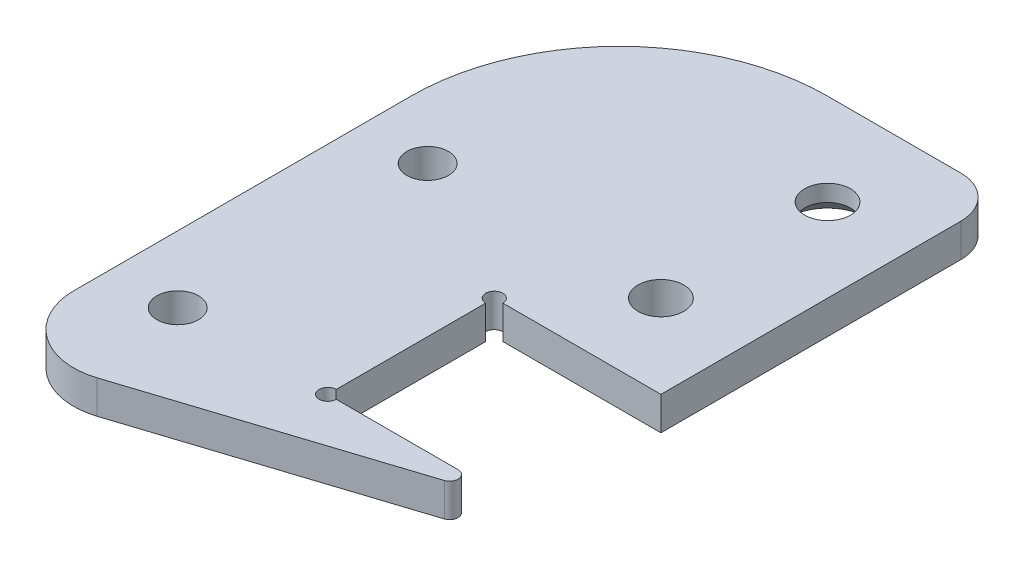
ISO-10303-21;
HEADER;
FILE_DESCRIPTION(('STEP AP214'),'2;1');
FILE_NAME('part.step','',(''),(''),'','','');
FILE_SCHEMA(('AUTOMOTIVE_DESIGN { 1 0 10303 214 1 1 1 1 }'));
ENDSEC;
DATA;
#1=APPLICATION_CONTEXT('core data for automotive mechanical design processes');
#2=APPLICATION_PROTOCOL_DEFINITION('international standard','automotive_design',2000,#1);
#3=PRODUCT_CONTEXT('',#1,'mechanical');
#4=PRODUCT('Part','Part','',(#3));
#5=PRODUCT_RELATED_PRODUCT_CATEGORY('part','',(#4));
#6=PRODUCT_DEFINITION_FORMATION('','',#4);
#7=PRODUCT_DEFINITION_CONTEXT('part definition',#1,'design');
#8=PRODUCT_DEFINITION('design','',#6,#7);
#9=PRODUCT_DEFINITION_SHAPE('','',#8);
#10=(LENGTH_UNIT() NAMED_UNIT(*) SI_UNIT(.MILLI.,.METRE.));
#11=(NAMED_UNIT(*) PLANE_ANGLE_UNIT() SI_UNIT($,.RADIAN.));
#12=(NAMED_UNIT(*) SI_UNIT($,.STERADIAN.) SOLID_ANGLE_UNIT());
#13=UNCERTAINTY_MEASURE_WITH_UNIT(LENGTH_MEASURE(1.E-05),#10,'distance_accuracy_value','');
#14=(GEOMETRIC_REPRESENTATION_CONTEXT(3) GLOBAL_UNCERTAINTY_ASSIGNED_CONTEXT((#13)) GLOBAL_UNIT_ASSIGNED_CONTEXT((#10,
#11,#12)) REPRESENTATION_CONTEXT('',''));
#15=CARTESIAN_POINT('',(0.,0.,0.));
#16=DIRECTION('',(0.,0.,1.));
#17=DIRECTION('',(1.,0.,0.));
#18=AXIS2_PLACEMENT_3D('',#15,#16,#17);
#19=CARTESIAN_POINT('',(33.,4.,-31.5));
#20=DIRECTION('',(0.,-1.,0.));
#21=DIRECTION('',(0.,0.,-1.));
#22=AXIS2_PLACEMENT_3D('',#19,#20,#21);
#23=PLANE('',#22);
#24=DIRECTION('',(0.,0.,-1.));
#25=VECTOR('',#24,1.);
#26=CARTESIAN_POINT('',(18.,4.,4.5));
#27=LINE('',#26,#25);
#28=CARTESIAN_POINT('',(18.,4.,23.475));
#29=VERTEX_POINT('',#28);
#30=CARTESIAN_POINT('',(18.,4.,5.525));
#31=VERTEX_POINT('',#30);
#32=EDGE_CURVE('E145',#29,#31,#27,.T.);
#33=ORIENTED_EDGE('',*,*,#32,.T.);
#34=CARTESIAN_POINT('',(18.,4.,4.5));
#35=DIRECTION('',(0.,-1.,0.));
#36=DIRECTION('',(0.,0.,-1.));
#37=AXIS2_PLACEMENT_3D('',#34,#35,#36);
#38=CIRCLE('',#37,1.025);
#39=CARTESIAN_POINT('',(19.025,4.,4.5));
#40=VERTEX_POINT('',#39);
#41=EDGE_CURVE('E131',#31,#40,#38,.T.);
#42=ORIENTED_EDGE('',*,*,#41,.T.);
#43=DIRECTION('',(1.,0.,0.));
#44=VECTOR('',#43,1.);
#45=CARTESIAN_POINT('',(38.,4.,4.5));
#46=LINE('',#45,#44);
#47=CARTESIAN_POINT('',(38.,4.,4.5));
#48=VERTEX_POINT('',#47);
#49=EDGE_CURVE('E141',#40,#48,#46,.T.);
#50=ORIENTED_EDGE('',*,*,#49,.T.);
#51=DIRECTION('',(0.,0.,-1.));
#52=VECTOR('',#51,1.);
#53=CARTESIAN_POINT('',(38.,4.,4.5));
#54=LINE('',#53,#52);
#55=CARTESIAN_POINT('',(38.,4.,-31.5));
#56=VERTEX_POINT('',#55);
#57=EDGE_CURVE('E184',#48,#56,#54,.T.);
#58=ORIENTED_EDGE('',*,*,#57,.T.);
#59=CARTESIAN_POINT('',(33.,4.,-31.5));
#60=DIRECTION('',(0.,1.,0.));
#61=DIRECTION('',(0.,0.,-1.));
#62=AXIS2_PLACEMENT_3D('',#59,#60,#61);
#63=CIRCLE('',#62,5.);
#64=CARTESIAN_POINT('',(33.,4.,-36.5));
#65=VERTEX_POINT('',#64);
#66=EDGE_CURVE('E261',#56,#65,#63,.T.);
#67=ORIENTED_EDGE('',*,*,#66,.T.);
#68=DIRECTION('',(-1.,0.,0.));
#69=VECTOR('',#68,1.);
#70=CARTESIAN_POINT('',(33.,4.,-36.5));
#71=LINE('',#70,#69);
#72=CARTESIAN_POINT('',(17.,4.,-36.5));
#73=VERTEX_POINT('',#72);
#74=EDGE_CURVE('E263',#65,#73,#71,.T.);
#75=ORIENTED_EDGE('',*,*,#74,.T.);
#76=CARTESIAN_POINT('',(17.,4.,-11.5));
#77=DIRECTION('',(0.,1.,0.));
#78=DIRECTION('',(0.,0.,1.));
#79=AXIS2_PLACEMENT_3D('',#76,#77,#78);
#80=CIRCLE('',#79,25.);
#81=CARTESIAN_POINT('',(-8.,4.,-11.5));
#82=VERTEX_POINT('',#81);
#83=EDGE_CURVE('E265',#73,#82,#80,.T.);
#84=ORIENTED_EDGE('',*,*,#83,.T.);
#85=DIRECTION('',(0.,0.,1.));
#86=VECTOR('',#85,1.);
#87=CARTESIAN_POINT('',(-8.,4.,-11.5));
#88=LINE('',#87,#86);
#89=CARTESIAN_POINT('',(-8.,4.,29.));
#90=VERTEX_POINT('',#89);
#91=EDGE_CURVE('E267',#82,#90,#88,.T.);
#92=ORIENTED_EDGE('',*,*,#91,.T.);
#93=CARTESIAN_POINT('',(0.,4.,29.));
#94=DIRECTION('',(0.,1.,0.));
#95=DIRECTION('',(0.,0.,1.));
#96=AXIS2_PLACEMENT_3D('',#93,#94,#95);
#97=CIRCLE('',#96,8.);
#98=CARTESIAN_POINT('',(2.456519700926,4.,36.6135084526756));
#99=VERTEX_POINT('',#98);
#100=EDGE_CURVE('E269',#90,#99,#97,.T.);
#101=ORIENTED_EDGE('',*,*,#100,.T.);
#102=DIRECTION('',(0.951688556584447,0.,-0.30706496261575));
#103=VECTOR('',#102,1.);
#104=CARTESIAN_POINT('',(33.9511181950039,4.,26.4516885565845));
#105=LINE('',#104,#103);
#106=CARTESIAN_POINT('',(33.9511181950039,4.,26.4516885565845));
#107=VERTEX_POINT('',#106);
#108=EDGE_CURVE('E271',#99,#107,#105,.T.);
#109=ORIENTED_EDGE('',*,*,#108,.T.);
#110=CARTESIAN_POINT('',(33.6440532323881,4.,25.5));
#111=DIRECTION('',(0.,1.,0.));
#112=DIRECTION('',(0.,0.,-1.));
#113=AXIS2_PLACEMENT_3D('',#110,#111,#112);
#114=CIRCLE('',#113,1.);
#115=CARTESIAN_POINT('',(33.6440532323881,4.,24.5));
#116=VERTEX_POINT('',#115);
#117=EDGE_CURVE('E273',#107,#116,#114,.T.);
#118=ORIENTED_EDGE('',*,*,#117,.T.);
#119=DIRECTION('',(-1.,0.,0.));
#120=VECTOR('',#119,1.);
#121=CARTESIAN_POINT('',(18.,4.,24.5));
#122=LINE('',#121,#120);
#123=CARTESIAN_POINT('',(19.025,4.,24.5));
#124=VERTEX_POINT('',#123);
#125=EDGE_CURVE('E155',#116,#124,#122,.T.);
#126=ORIENTED_EDGE('',*,*,#125,.T.);
#127=CARTESIAN_POINT('',(18.,4.,24.5));
#128=DIRECTION('',(0.,-1.,0.));
#129=DIRECTION('',(0.,0.,-1.));
#130=AXIS2_PLACEMENT_3D('',#127,#128,#129);
#131=CIRCLE('',#130,1.025);
#132=EDGE_CURVE('E248',#124,#29,#131,.T.);
#133=ORIENTED_EDGE('',*,*,#132,.T.);
#134=EDGE_LOOP('',(#33,#42,#50,#58,#67,#75,#84,#92,#101,#109,#118,#126,#133));
#135=FACE_BOUND('',#134,.T.);
#136=CARTESIAN_POINT('',(5.88426073792755E-12,4.,-5.49999999982597));
#137=DIRECTION('',(0.,1.,0.));
#138=DIRECTION('',(0.,0.,1.));
#139=AXIS2_PLACEMENT_3D('',#136,#137,#138);
#140=CIRCLE('',#139,2.5);
#141=CARTESIAN_POINT('',(5.88426073792755E-12,4.,-2.99999999982597));
#142=VERTEX_POINT('',#141);
#143=EDGE_CURVE('E163',#142,#142,#140,.T.);
#144=ORIENTED_EDGE('',*,*,#143,.F.);
#145=EDGE_LOOP('',(#144));
#146=FACE_BOUND('',#145,.T.);
#147=CARTESIAN_POINT('',(28.0000000000034,4.,-5.49999999999137));
#148=DIRECTION('',(0.,1.,0.));
#149=DIRECTION('',(0.,0.,1.));
#150=AXIS2_PLACEMENT_3D('',#147,#148,#149);
#151=CIRCLE('',#150,2.74999999999999);
#152=CARTESIAN_POINT('',(28.0000000000034,4.,-2.74999999999137));
#153=VERTEX_POINT('',#152);
#154=EDGE_CURVE('E253',#153,#153,#151,.T.);
#155=ORIENTED_EDGE('',*,*,#154,.F.);
#156=EDGE_LOOP('',(#155));
#157=FACE_BOUND('',#156,.T.);
#158=CARTESIAN_POINT('',(28.0000000000037,4.,-25.4999999999914));
#159=DIRECTION('',(0.,1.,0.));
#160=DIRECTION('',(0.,0.,1.));
#161=AXIS2_PLACEMENT_3D('',#158,#159,#160);
#162=CIRCLE('',#161,2.75);
#163=CARTESIAN_POINT('',(28.0000000000037,4.,-22.7499999999914));
#164=VERTEX_POINT('',#163);
#165=EDGE_CURVE('E245',#164,#164,#162,.T.);
#166=ORIENTED_EDGE('',*,*,#165,.F.);
#167=EDGE_LOOP('',(#166));
#168=FACE_BOUND('',#167,.T.);
#169=CARTESIAN_POINT('',(2.88657986402541E-12,4.,24.5000000001652));
#170=DIRECTION('',(0.,1.,0.));
#171=DIRECTION('',(0.,0.,1.));
#172=AXIS2_PLACEMENT_3D('',#169,#170,#171);
#173=CIRCLE('',#172,2.5);
#174=CARTESIAN_POINT('',(2.88657986402541E-12,4.,27.0000000001652));
#175=VERTEX_POINT('',#174);
#176=EDGE_CURVE('E241',#175,#175,#173,.T.);
#177=ORIENTED_EDGE('',*,*,#176,.F.);
#178=EDGE_LOOP('',(#177));
#179=FACE_BOUND('',#178,.T.);
#180=ADVANCED_FACE('F37',(#135,#146,#157,#168,#179),#23,.F.);
#181=CARTESIAN_POINT('',(33.,0.,-31.5));
#182=DIRECTION('',(0.,-1.,0.));
#183=DIRECTION('',(0.,0.,-1.));
#184=AXIS2_PLACEMENT_3D('',#181,#182,#183);
#185=PLANE('',#184);
#186=CARTESIAN_POINT('',(18.,0.,4.5));
#187=DIRECTION('',(0.,-1.,0.));
#188=DIRECTION('',(0.,0.,-1.));
#189=AXIS2_PLACEMENT_3D('',#186,#187,#188);
#190=CIRCLE('',#189,1.025);
#191=CARTESIAN_POINT('',(18.,0.,5.525));
#192=VERTEX_POINT('',#191);
#193=CARTESIAN_POINT('',(19.025,0.,4.5));
#194=VERTEX_POINT('',#193);
#195=EDGE_CURVE('E60',#192,#194,#190,.T.);
#196=ORIENTED_EDGE('',*,*,#195,.F.);
#197=DIRECTION('',(0.,0.,-1.));
#198=VECTOR('',#197,1.);
#199=CARTESIAN_POINT('',(18.,0.,4.5));
#200=LINE('',#199,#198);
#201=CARTESIAN_POINT('',(18.,0.,23.475));
#202=VERTEX_POINT('',#201);
#203=EDGE_CURVE('E180',#202,#192,#200,.T.);
#204=ORIENTED_EDGE('',*,*,#203,.F.);
#205=CARTESIAN_POINT('',(18.,0.,24.5));
#206=DIRECTION('',(0.,-1.,0.));
#207=DIRECTION('',(0.,0.,-1.));
#208=AXIS2_PLACEMENT_3D('',#205,#206,#207);
#209=CIRCLE('',#208,1.025);
#210=CARTESIAN_POINT('',(19.025,0.,24.5));
#211=VERTEX_POINT('',#210);
#212=EDGE_CURVE('E53',#211,#202,#209,.T.);
#213=ORIENTED_EDGE('',*,*,#212,.F.);
#214=DIRECTION('',(-1.,0.,0.));
#215=VECTOR('',#214,1.);
#216=CARTESIAN_POINT('',(18.,0.,24.5));
#217=LINE('',#216,#215);
#218=CARTESIAN_POINT('',(33.6440532323881,0.,24.5));
#219=VERTEX_POINT('',#218);
#220=EDGE_CURVE('E177',#219,#211,#217,.T.);
#221=ORIENTED_EDGE('',*,*,#220,.F.);
#222=CARTESIAN_POINT('',(33.6440532323881,0.,25.5));
#223=DIRECTION('',(0.,1.,0.));
#224=DIRECTION('',(0.,0.,-1.));
#225=AXIS2_PLACEMENT_3D('',#222,#223,#224);
#226=CIRCLE('',#225,1.);
#227=CARTESIAN_POINT('',(33.9511181950039,0.,26.4516885565845));
#228=VERTEX_POINT('',#227);
#229=EDGE_CURVE('E175',#228,#219,#226,.T.);
#230=ORIENTED_EDGE('',*,*,#229,.F.);
#231=DIRECTION('',(0.951688556584447,0.,-0.30706496261575));
#232=VECTOR('',#231,1.);
#233=CARTESIAN_POINT('',(33.9511181950039,0.,26.4516885565845));
#234=LINE('',#233,#232);
#235=CARTESIAN_POINT('',(2.456519700926,0.,36.6135084526756));
#236=VERTEX_POINT('',#235);
#237=EDGE_CURVE('E173',#236,#228,#234,.T.);
#238=ORIENTED_EDGE('',*,*,#237,.F.);
#239=CARTESIAN_POINT('',(0.,0.,29.));
#240=DIRECTION('',(0.,1.,0.));
#241=DIRECTION('',(0.,0.,1.));
#242=AXIS2_PLACEMENT_3D('',#239,#240,#241);
#243=CIRCLE('',#242,8.);
#244=CARTESIAN_POINT('',(-8.,0.,29.));
#245=VERTEX_POINT('',#244);
#246=EDGE_CURVE('E171',#245,#236,#243,.T.);
#247=ORIENTED_EDGE('',*,*,#246,.F.);
#248=DIRECTION('',(0.,0.,1.));
#249=VECTOR('',#248,1.);
#250=CARTESIAN_POINT('',(-8.,0.,-11.5));
#251=LINE('',#250,#249);
#252=CARTESIAN_POINT('',(-8.,0.,-11.5));
#253=VERTEX_POINT('',#252);
#254=EDGE_CURVE('E169',#253,#245,#251,.T.);
#255=ORIENTED_EDGE('',*,*,#254,.F.);
#256=CARTESIAN_POINT('',(17.,0.,-11.5));
#257=DIRECTION('',(0.,1.,0.));
#258=DIRECTION('',(0.,0.,1.));
#259=AXIS2_PLACEMENT_3D('',#256,#257,#258);
#260=CIRCLE('',#259,25.);
#261=CARTESIAN_POINT('',(17.,0.,-36.5));
#262=VERTEX_POINT('',#261);
#263=EDGE_CURVE('E167',#262,#253,#260,.T.);
#264=ORIENTED_EDGE('',*,*,#263,.F.);
#265=DIRECTION('',(-1.,0.,0.));
#266=VECTOR('',#265,1.);
#267=CARTESIAN_POINT('',(33.,0.,-36.5));
#268=LINE('',#267,#266);
#269=CARTESIAN_POINT('',(33.,0.,-36.5));
#270=VERTEX_POINT('',#269);
#271=EDGE_CURVE('E165',#270,#262,#268,.T.);
#272=ORIENTED_EDGE('',*,*,#271,.F.);
#273=CARTESIAN_POINT('',(33.,0.,-31.5));
#274=DIRECTION('',(0.,1.,0.));
#275=DIRECTION('',(0.,0.,-1.));
#276=AXIS2_PLACEMENT_3D('',#273,#274,#275);
#277=CIRCLE('',#276,5.);
#278=CARTESIAN_POINT('',(38.,0.,-31.5));
#279=VERTEX_POINT('',#278);
#280=EDGE_CURVE('E162',#279,#270,#277,.T.);
#281=ORIENTED_EDGE('',*,*,#280,.F.);
#282=DIRECTION('',(0.,0.,-1.));
#283=VECTOR('',#282,1.);
#284=CARTESIAN_POINT('',(38.,0.,4.5));
#285=LINE('',#284,#283);
#286=CARTESIAN_POINT('',(38.,0.,4.5));
#287=VERTEX_POINT('',#286);
#288=EDGE_CURVE('E159',#287,#279,#285,.T.);
#289=ORIENTED_EDGE('',*,*,#288,.F.);
#290=DIRECTION('',(1.,0.,0.));
#291=VECTOR('',#290,1.);
#292=CARTESIAN_POINT('',(38.,0.,4.5));
#293=LINE('',#292,#291);
#294=EDGE_CURVE('E183',#194,#287,#293,.T.);
#295=ORIENTED_EDGE('',*,*,#294,.F.);
#296=EDGE_LOOP('',(#196,#204,#213,#221,#230,#238,#247,#255,#264,#272,#281,#289,#295));
#297=FACE_BOUND('',#296,.T.);
#298=CARTESIAN_POINT('',(28.0000000000037,0.,-25.4999999999914));
#299=DIRECTION('',(0.,-1.,0.));
#300=DIRECTION('',(0.,0.,-1.));
#301=AXIS2_PLACEMENT_3D('',#298,#299,#300);
#302=CIRCLE('',#301,4.74999999999998);
#303=CARTESIAN_POINT('',(28.0000000000037,0.,-30.2499999999913));
#304=VERTEX_POINT('',#303);
#305=EDGE_CURVE('E209',#304,#304,#302,.F.);
#306=ORIENTED_EDGE('',*,*,#305,.T.);
#307=EDGE_LOOP('',(#306));
#308=FACE_BOUND('',#307,.T.);
#309=CARTESIAN_POINT('',(5.88426073792755E-12,0.,-5.49999999982597));
#310=DIRECTION('',(0.,1.,0.));
#311=DIRECTION('',(0.,0.,1.));
#312=AXIS2_PLACEMENT_3D('',#309,#310,#311);
#313=CIRCLE('',#312,2.5);
#314=CARTESIAN_POINT('',(5.88426073792755E-12,0.,-2.99999999982597));
#315=VERTEX_POINT('',#314);
#316=EDGE_CURVE('E232',#315,#315,#313,.T.);
#317=ORIENTED_EDGE('',*,*,#316,.T.);
#318=EDGE_LOOP('',(#317));
#319=FACE_BOUND('',#318,.T.);
#320=CARTESIAN_POINT('',(28.0000000000034,0.,-5.49999999999137));
#321=DIRECTION('',(0.,1.,0.));
#322=DIRECTION('',(0.,0.,1.));
#323=AXIS2_PLACEMENT_3D('',#320,#321,#322);
#324=CIRCLE('',#323,2.74999999999999);
#325=CARTESIAN_POINT('',(28.0000000000034,0.,-2.74999999999137));
#326=VERTEX_POINT('',#325);
#327=EDGE_CURVE('E236',#326,#326,#324,.T.);
#328=ORIENTED_EDGE('',*,*,#327,.T.);
#329=EDGE_LOOP('',(#328));
#330=FACE_BOUND('',#329,.T.);
#331=CARTESIAN_POINT('',(2.88657986402541E-12,0.,24.5000000001652));
#332=DIRECTION('',(0.,1.,0.));
#333=DIRECTION('',(0.,0.,1.));
#334=AXIS2_PLACEMENT_3D('',#331,#332,#333);
#335=CIRCLE('',#334,2.5);
#336=CARTESIAN_POINT('',(2.88657986402541E-12,0.,27.0000000001652));
#337=VERTEX_POINT('',#336);
#338=EDGE_CURVE('E239',#337,#337,#335,.T.);
#339=ORIENTED_EDGE('',*,*,#338,.T.);
#340=EDGE_LOOP('',(#339));
#341=FACE_BOUND('',#340,.T.);
#342=ADVANCED_FACE('F223',(#297,#308,#319,#330,#341),#185,.T.);
#343=CARTESIAN_POINT('',(38.,4.,4.5));
#344=DIRECTION('',(-1.,0.,0.));
#345=DIRECTION('',(0.,0.,1.));
#346=AXIS2_PLACEMENT_3D('',#343,#344,#345);
#347=PLANE('',#346);
#348=ORIENTED_EDGE('',*,*,#288,.T.);
#349=DIRECTION('',(0.,-1.,0.));
#350=VECTOR('',#349,1.);
#351=CARTESIAN_POINT('',(38.,4.,-31.5));
#352=LINE('',#351,#350);
#353=EDGE_CURVE('E206',#56,#279,#352,.T.);
#354=ORIENTED_EDGE('',*,*,#353,.F.);
#355=ORIENTED_EDGE('',*,*,#57,.F.);
#356=DIRECTION('',(0.,-1.,0.));
#357=VECTOR('',#356,1.);
#358=CARTESIAN_POINT('',(38.,4.,4.5));
#359=LINE('',#358,#357);
#360=EDGE_CURVE('E150',#48,#287,#359,.T.);
#361=ORIENTED_EDGE('',*,*,#360,.T.);
#362=EDGE_LOOP('',(#348,#354,#355,#361));
#363=FACE_BOUND('',#362,.T.);
#364=ADVANCED_FACE('F226',(#363),#347,.F.);
#365=CARTESIAN_POINT('',(33.,4.,-31.5));
#366=DIRECTION('',(0.,-1.,0.));
#367=DIRECTION('',(0.,0.,-1.));
#368=AXIS2_PLACEMENT_3D('',#365,#366,#367);
#369=CYLINDRICAL_SURFACE('',#368,5.);
#370=ORIENTED_EDGE('',*,*,#280,.T.);
#371=DIRECTION('',(0.,-1.,0.));
#372=VECTOR('',#371,1.);
#373=CARTESIAN_POINT('',(33.,4.,-36.5));
#374=LINE('',#373,#372);
#375=EDGE_CURVE('E203',#65,#270,#374,.T.);
#376=ORIENTED_EDGE('',*,*,#375,.F.);
#377=ORIENTED_EDGE('',*,*,#66,.F.);
#378=ORIENTED_EDGE('',*,*,#353,.T.);
#379=EDGE_LOOP('',(#370,#376,#377,#378));
#380=FACE_BOUND('',#379,.T.);
#381=ADVANCED_FACE('F297',(#380),#369,.T.);
#382=CARTESIAN_POINT('',(33.,4.,-36.5));
#383=DIRECTION('',(0.,0.,1.));
#384=DIRECTION('',(1.,0.,0.));
#385=AXIS2_PLACEMENT_3D('',#382,#383,#384);
#386=PLANE('',#385);
#387=ORIENTED_EDGE('',*,*,#271,.T.);
#388=DIRECTION('',(0.,-1.,0.));
#389=VECTOR('',#388,1.);
#390=CARTESIAN_POINT('',(17.,4.,-36.5));
#391=LINE('',#390,#389);
#392=EDGE_CURVE('E200',#73,#262,#391,.T.);
#393=ORIENTED_EDGE('',*,*,#392,.F.);
#394=ORIENTED_EDGE('',*,*,#74,.F.);
#395=ORIENTED_EDGE('',*,*,#375,.T.);
#396=EDGE_LOOP('',(#387,#393,#394,#395));
#397=FACE_BOUND('',#396,.T.);
#398=ADVANCED_FACE('F300',(#397),#386,.F.);
#399=CARTESIAN_POINT('',(17.,4.,-11.5));
#400=DIRECTION('',(0.,-1.,0.));
#401=DIRECTION('',(0.,0.,-1.));
#402=AXIS2_PLACEMENT_3D('',#399,#400,#401);
#403=CYLINDRICAL_SURFACE('',#402,25.);
#404=ORIENTED_EDGE('',*,*,#263,.T.);
#405=DIRECTION('',(0.,-1.,0.));
#406=VECTOR('',#405,1.);
#407=CARTESIAN_POINT('',(-8.,4.,-11.5));
#408=LINE('',#407,#406);
#409=EDGE_CURVE('E197',#82,#253,#408,.T.);
#410=ORIENTED_EDGE('',*,*,#409,.F.);
#411=ORIENTED_EDGE('',*,*,#83,.F.);
#412=ORIENTED_EDGE('',*,*,#392,.T.);
#413=EDGE_LOOP('',(#404,#410,#411,#412));
#414=FACE_BOUND('',#413,.T.);
#415=ADVANCED_FACE('F305',(#414),#403,.T.);
#416=CARTESIAN_POINT('',(-8.,4.,-11.5));
#417=DIRECTION('',(1.,0.,0.));
#418=DIRECTION('',(0.,0.,-1.));
#419=AXIS2_PLACEMENT_3D('',#416,#417,#418);
#420=PLANE('',#419);
#421=ORIENTED_EDGE('',*,*,#254,.T.);
#422=DIRECTION('',(0.,-1.,0.));
#423=VECTOR('',#422,1.);
#424=CARTESIAN_POINT('',(-8.,4.,29.));
#425=LINE('',#424,#423);
#426=EDGE_CURVE('E194',#90,#245,#425,.T.);
#427=ORIENTED_EDGE('',*,*,#426,.F.);
#428=ORIENTED_EDGE('',*,*,#91,.F.);
#429=ORIENTED_EDGE('',*,*,#409,.T.);
#430=EDGE_LOOP('',(#421,#427,#428,#429));
#431=FACE_BOUND('',#430,.T.);
#432=ADVANCED_FACE('F311',(#431),#420,.F.);
#433=CARTESIAN_POINT('',(0.,4.,29.));
#434=DIRECTION('',(0.,-1.,0.));
#435=DIRECTION('',(0.,0.,-1.));
#436=AXIS2_PLACEMENT_3D('',#433,#434,#435);
#437=CYLINDRICAL_SURFACE('',#436,8.);
#438=ORIENTED_EDGE('',*,*,#246,.T.);
#439=DIRECTION('',(0.,-1.,0.));
#440=VECTOR('',#439,1.);
#441=CARTESIAN_POINT('',(2.456519700926,4.,36.6135084526756));
#442=LINE('',#441,#440);
#443=EDGE_CURVE('E191',#99,#236,#442,.T.);
#444=ORIENTED_EDGE('',*,*,#443,.F.);
#445=ORIENTED_EDGE('',*,*,#100,.F.);
#446=ORIENTED_EDGE('',*,*,#426,.T.);
#447=EDGE_LOOP('',(#438,#444,#445,#446));
#448=FACE_BOUND('',#447,.T.);
#449=ADVANCED_FACE('F315',(#448),#437,.T.);
#450=CARTESIAN_POINT('',(33.9511181950039,4.,26.4516885565845));
#451=DIRECTION('',(-0.30706496261575,0.,-0.951688556584447));
#452=DIRECTION('',(-0.951688556584447,0.,0.30706496261575));
#453=AXIS2_PLACEMENT_3D('',#450,#451,#452);
#454=PLANE('',#453);
#455=ORIENTED_EDGE('',*,*,#237,.T.);
#456=DIRECTION('',(0.,-1.,0.));
#457=VECTOR('',#456,1.);
#458=CARTESIAN_POINT('',(33.9511181950039,4.,26.4516885565845));
#459=LINE('',#458,#457);
#460=EDGE_CURVE('E188',#107,#228,#459,.T.);
#461=ORIENTED_EDGE('',*,*,#460,.F.);
#462=ORIENTED_EDGE('',*,*,#108,.F.);
#463=ORIENTED_EDGE('',*,*,#443,.T.);
#464=EDGE_LOOP('',(#455,#461,#462,#463));
#465=FACE_BOUND('',#464,.T.);
#466=ADVANCED_FACE('F320',(#465),#454,.F.);
#467=CARTESIAN_POINT('',(33.6440532323881,4.,25.5));
#468=DIRECTION('',(0.,-1.,0.));
#469=DIRECTION('',(0.,0.,-1.));
#470=AXIS2_PLACEMENT_3D('',#467,#468,#469);
#471=CYLINDRICAL_SURFACE('',#470,1.);
#472=ORIENTED_EDGE('',*,*,#229,.T.);
#473=DIRECTION('',(0.,-1.,0.));
#474=VECTOR('',#473,1.);
#475=CARTESIAN_POINT('',(33.6440532323881,4.,24.5));
#476=LINE('',#475,#474);
#477=EDGE_CURVE('E153',#116,#219,#476,.T.);
#478=ORIENTED_EDGE('',*,*,#477,.F.);
#479=ORIENTED_EDGE('',*,*,#117,.F.);
#480=ORIENTED_EDGE('',*,*,#460,.T.);
#481=EDGE_LOOP('',(#472,#478,#479,#480));
#482=FACE_BOUND('',#481,.T.);
#483=ADVANCED_FACE('F322',(#482),#471,.T.);
#484=CARTESIAN_POINT('',(18.,4.,24.5));
#485=DIRECTION('',(0.,0.,1.));
#486=DIRECTION('',(1.,0.,0.));
#487=AXIS2_PLACEMENT_3D('',#484,#485,#486);
#488=PLANE('',#487);
#489=ORIENTED_EDGE('',*,*,#220,.T.);
#490=DIRECTION('',(0.,1.,0.));
#491=VECTOR('',#490,1.);
#492=CARTESIAN_POINT('',(19.025,-0.999999999999999,24.5));
#493=LINE('',#492,#491);
#494=EDGE_CURVE('E242',#211,#124,#493,.T.);
#495=ORIENTED_EDGE('',*,*,#494,.T.);
#496=ORIENTED_EDGE('',*,*,#125,.F.);
#497=ORIENTED_EDGE('',*,*,#477,.T.);
#498=EDGE_LOOP('',(#489,#495,#496,#497));
#499=FACE_BOUND('',#498,.T.);
#500=ADVANCED_FACE('F279',(#499),#488,.F.);
#501=CARTESIAN_POINT('',(18.,4.,4.5));
#502=DIRECTION('',(-1.,0.,0.));
#503=DIRECTION('',(0.,0.,1.));
#504=AXIS2_PLACEMENT_3D('',#501,#502,#503);
#505=PLANE('',#504);
#506=ORIENTED_EDGE('',*,*,#203,.T.);
#507=DIRECTION('',(0.,1.,0.));
#508=VECTOR('',#507,1.);
#509=CARTESIAN_POINT('',(18.,-0.999999999999999,5.525));
#510=LINE('',#509,#508);
#511=EDGE_CURVE('E146',#192,#31,#510,.T.);
#512=ORIENTED_EDGE('',*,*,#511,.T.);
#513=ORIENTED_EDGE('',*,*,#32,.F.);
#514=DIRECTION('',(0.,1.,0.));
#515=VECTOR('',#514,1.);
#516=CARTESIAN_POINT('',(18.,-0.999999999999999,23.475));
#517=LINE('',#516,#515);
#518=EDGE_CURVE('E11',#29,#202,#517,.F.);
#519=ORIENTED_EDGE('',*,*,#518,.T.);
#520=EDGE_LOOP('',(#506,#512,#513,#519));
#521=FACE_BOUND('',#520,.T.);
#522=ADVANCED_FACE('F289',(#521),#505,.F.);
#523=CARTESIAN_POINT('',(38.,4.,4.5));
#524=DIRECTION('',(0.,0.,-1.));
#525=DIRECTION('',(-1.,0.,0.));
#526=AXIS2_PLACEMENT_3D('',#523,#524,#525);
#527=PLANE('',#526);
#528=ORIENTED_EDGE('',*,*,#49,.F.);
#529=DIRECTION('',(0.,1.,0.));
#530=VECTOR('',#529,1.);
#531=CARTESIAN_POINT('',(19.025,-0.999999999999999,4.5));
#532=LINE('',#531,#530);
#533=EDGE_CURVE('E46',#40,#194,#532,.F.);
#534=ORIENTED_EDGE('',*,*,#533,.T.);
#535=ORIENTED_EDGE('',*,*,#294,.T.);
#536=ORIENTED_EDGE('',*,*,#360,.F.);
#537=EDGE_LOOP('',(#528,#534,#535,#536));
#538=FACE_BOUND('',#537,.T.);
#539=ADVANCED_FACE('F148',(#538),#527,.F.);
#540=CARTESIAN_POINT('',(5.88426073792755E-12,4.,-5.49999999982597));
#541=DIRECTION('',(0.,-1.,0.));
#542=DIRECTION('',(0.,0.,-1.));
#543=AXIS2_PLACEMENT_3D('',#540,#541,#542);
#544=CYLINDRICAL_SURFACE('',#543,2.5);
#545=ORIENTED_EDGE('',*,*,#143,.T.);
#546=EDGE_LOOP('',(#545));
#547=FACE_BOUND('',#546,.T.);
#548=ORIENTED_EDGE('',*,*,#316,.F.);
#549=EDGE_LOOP('',(#548));
#550=FACE_BOUND('',#549,.T.);
#551=ADVANCED_FACE('F338',(#547,#550),#544,.F.);
#552=CARTESIAN_POINT('',(28.0000000000034,4.,-5.49999999999137));
#553=DIRECTION('',(0.,-1.,0.));
#554=DIRECTION('',(0.,0.,-1.));
#555=AXIS2_PLACEMENT_3D('',#552,#553,#554);
#556=CYLINDRICAL_SURFACE('',#555,2.74999999999999);
#557=ORIENTED_EDGE('',*,*,#154,.T.);
#558=EDGE_LOOP('',(#557));
#559=FACE_BOUND('',#558,.T.);
#560=ORIENTED_EDGE('',*,*,#327,.F.);
#561=EDGE_LOOP('',(#560));
#562=FACE_BOUND('',#561,.T.);
#563=ADVANCED_FACE('F376',(#559,#562),#556,.F.);
#564=CARTESIAN_POINT('',(28.0000000000037,4.,-25.4999999999914));
#565=DIRECTION('',(0.,-1.,0.));
#566=DIRECTION('',(0.,0.,-1.));
#567=AXIS2_PLACEMENT_3D('',#564,#565,#566);
#568=CYLINDRICAL_SURFACE('',#567,2.75);
#569=CARTESIAN_POINT('',(28.0000000000037,1.99999999999999,-25.4999999999914));
#570=DIRECTION('',(0.,-1.,0.));
#571=DIRECTION('',(0.,0.,-1.));
#572=AXIS2_PLACEMENT_3D('',#569,#570,#571);
#573=CIRCLE('',#572,2.75);
#574=CARTESIAN_POINT('',(28.0000000000037,1.99999999999999,-28.2499999999914));
#575=VERTEX_POINT('',#574);
#576=EDGE_CURVE('E136',#575,#575,#573,.T.);
#577=ORIENTED_EDGE('',*,*,#576,.T.);
#578=EDGE_LOOP('',(#577));
#579=FACE_BOUND('',#578,.T.);
#580=ORIENTED_EDGE('',*,*,#165,.T.);
#581=EDGE_LOOP('',(#580));
#582=FACE_BOUND('',#581,.T.);
#583=ADVANCED_FACE('F215',(#579,#582),#568,.F.);
#584=CARTESIAN_POINT('',(2.88657986402541E-12,4.,24.5000000001652));
#585=DIRECTION('',(0.,-1.,0.));
#586=DIRECTION('',(0.,0.,-1.));
#587=AXIS2_PLACEMENT_3D('',#584,#585,#586);
#588=CYLINDRICAL_SURFACE('',#587,2.5);
#589=ORIENTED_EDGE('',*,*,#176,.T.);
#590=EDGE_LOOP('',(#589));
#591=FACE_BOUND('',#590,.T.);
#592=ORIENTED_EDGE('',*,*,#338,.F.);
#593=EDGE_LOOP('',(#592));
#594=FACE_BOUND('',#593,.T.);
#595=ADVANCED_FACE('F220',(#591,#594),#588,.F.);
#596=CARTESIAN_POINT('',(28.0000000000037,0.,-25.4999999999914));
#597=DIRECTION('',(0.,-1.,0.));
#598=DIRECTION('',(0.,0.,-1.));
#599=AXIS2_PLACEMENT_3D('',#596,#597,#598);
#600=CONICAL_SURFACE('',#599,4.74999999999998,0.785398163397446);
#601=ORIENTED_EDGE('',*,*,#576,.F.);
#602=EDGE_LOOP('',(#601));
#603=FACE_BOUND('',#602,.T.);
#604=ORIENTED_EDGE('',*,*,#305,.F.);
#605=EDGE_LOOP('',(#604));
#606=FACE_BOUND('',#605,.T.);
#607=ADVANCED_FACE('F40',(#603,#606),#600,.F.);
#608=CARTESIAN_POINT('',(18.,-0.999999999999999,4.5));
#609=DIRECTION('',(0.,1.,0.));
#610=DIRECTION('',(0.,0.,1.));
#611=AXIS2_PLACEMENT_3D('',#608,#609,#610);
#612=CYLINDRICAL_SURFACE('',#611,1.025);
#613=ORIENTED_EDGE('',*,*,#195,.T.);
#614=ORIENTED_EDGE('',*,*,#533,.F.);
#615=ORIENTED_EDGE('',*,*,#41,.F.);
#616=ORIENTED_EDGE('',*,*,#511,.F.);
#617=EDGE_LOOP('',(#613,#614,#615,#616));
#618=FACE_BOUND('',#617,.T.);
#619=ADVANCED_FACE('F130',(#618),#612,.F.);
#620=CARTESIAN_POINT('',(18.,-0.999999999999999,24.5));
#621=DIRECTION('',(0.,1.,0.));
#622=DIRECTION('',(0.,0.,1.));
#623=AXIS2_PLACEMENT_3D('',#620,#621,#622);
#624=CYLINDRICAL_SURFACE('',#623,1.025);
#625=ORIENTED_EDGE('',*,*,#212,.T.);
#626=ORIENTED_EDGE('',*,*,#518,.F.);
#627=ORIENTED_EDGE('',*,*,#132,.F.);
#628=ORIENTED_EDGE('',*,*,#494,.F.);
#629=EDGE_LOOP('',(#625,#626,#627,#628));
#630=FACE_BOUND('',#629,.T.);
#631=ADVANCED_FACE('F281',(#630),#624,.F.);
#632=CLOSED_SHELL('',(#180,#342,#364,#381,#398,#415,#432,#449,#466,#483,#500,#522,#539,#551,
#563,#583,#595,#607,#619,#631));
#633=MANIFOLD_SOLID_BREP('B2',#632);
#634=ADVANCED_BREP_SHAPE_REPRESENTATION('',(#18,#633),#14);
#635=SHAPE_DEFINITION_REPRESENTATION(#9,#634);
ENDSEC;
END-ISO-10303-21;
